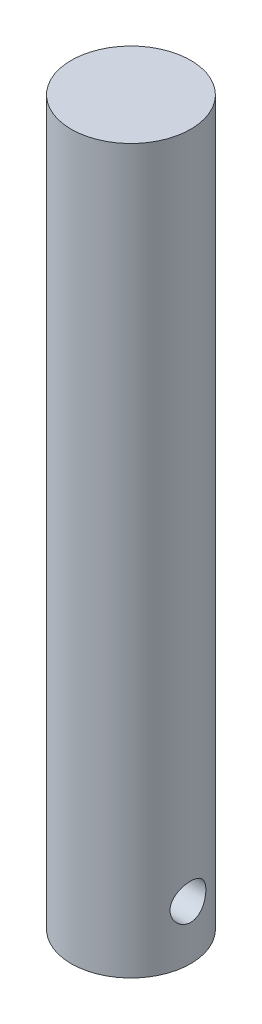
ISO-10303-21;
HEADER;
FILE_DESCRIPTION(('STEP AP214'),'2;1');
FILE_NAME('part.step','',(''),(''),'','','');
FILE_SCHEMA(('AUTOMOTIVE_DESIGN { 1 0 10303 214 1 1 1 1 }'));
ENDSEC;
DATA;
#1=APPLICATION_CONTEXT('core data for automotive mechanical design processes');
#2=APPLICATION_PROTOCOL_DEFINITION('international standard','automotive_design',2000,#1);
#3=PRODUCT_CONTEXT('',#1,'mechanical');
#4=PRODUCT('Part','Part','',(#3));
#5=PRODUCT_RELATED_PRODUCT_CATEGORY('part','',(#4));
#6=PRODUCT_DEFINITION_FORMATION('','',#4);
#7=PRODUCT_DEFINITION_CONTEXT('part definition',#1,'design');
#8=PRODUCT_DEFINITION('design','',#6,#7);
#9=PRODUCT_DEFINITION_SHAPE('','',#8);
#10=(LENGTH_UNIT() NAMED_UNIT(*) SI_UNIT(.MILLI.,.METRE.));
#11=(NAMED_UNIT(*) PLANE_ANGLE_UNIT() SI_UNIT($,.RADIAN.));
#12=(NAMED_UNIT(*) SI_UNIT($,.STERADIAN.) SOLID_ANGLE_UNIT());
#13=UNCERTAINTY_MEASURE_WITH_UNIT(LENGTH_MEASURE(1.E-05),#10,'distance_accuracy_value','');
#14=(GEOMETRIC_REPRESENTATION_CONTEXT(3) GLOBAL_UNCERTAINTY_ASSIGNED_CONTEXT((#13)) GLOBAL_UNIT_ASSIGNED_CONTEXT((#10,
#11,#12)) REPRESENTATION_CONTEXT('',''));
#15=CARTESIAN_POINT('',(0.,0.,0.));
#16=DIRECTION('',(0.,0.,1.));
#17=DIRECTION('',(1.,0.,0.));
#18=AXIS2_PLACEMENT_3D('',#15,#16,#17);
#19=CARTESIAN_POINT('',(0.,-21.,0.));
#20=DIRECTION('',(0.,1.,0.));
#21=DIRECTION('',(0.,0.,1.));
#22=AXIS2_PLACEMENT_3D('',#19,#20,#21);
#23=CYLINDRICAL_SURFACE('',#22,10.);
#24=CARTESIAN_POINT('',(-9.53939201416945,-12.,-3.));
#25=CARTESIAN_POINT('',(-9.53939371453959,-12.1643890958848,-2.99999795267528));
#26=CARTESIAN_POINT('',(-9.54368780418137,-12.3287984482881,-2.98644216334284));
#27=CARTESIAN_POINT('',(-9.56033156605799,-12.6528104991839,-2.93271688893498));
#28=CARTESIAN_POINT('',(-9.57268392986936,-12.8124115730029,-2.89253851147156));
#29=CARTESIAN_POINT('',(-9.60392204971265,-13.1220694565435,-2.78705506539911));
#30=CARTESIAN_POINT('',(-9.62279693406464,-13.2721416592662,-2.72179178788487));
#31=CARTESIAN_POINT('',(-9.66493865095134,-13.5592438679906,-2.56812843835858));
#32=CARTESIAN_POINT('',(-9.68820614082039,-13.6962719173689,-2.47972490274105));
#33=CARTESIAN_POINT('',(-9.73733724371531,-13.9577327811548,-2.27929508283254));
#34=CARTESIAN_POINT('',(-9.76325616623271,-14.0816917958926,-2.16666414351613));
#35=CARTESIAN_POINT('',(-9.81429723873514,-14.309275902645,-1.9222724751592));
#36=CARTESIAN_POINT('',(-9.8394192859541,-14.4128983808998,-1.79050929092222));
#37=CARTESIAN_POINT('',(-9.88666429158777,-14.5989253996666,-1.50822287558738));
#38=CARTESIAN_POINT('',(-9.90871448684808,-14.6808468488856,-1.35736804267163));
#39=CARTESIAN_POINT('',(-9.94668871841369,-14.8179745180855,-1.04324929073871));
#40=CARTESIAN_POINT('',(-9.96261407578992,-14.8731864997149,-0.879988056775822));
#41=CARTESIAN_POINT('',(-9.98615292007177,-14.953760002181,-0.550647705261659));
#42=CARTESIAN_POINT('',(-9.99399114738673,-14.9799302553054,-0.384782797907603));
#43=CARTESIAN_POINT('',(-10.001264030027,-15.0042346492929,-0.0508436474986282));
#44=CARTESIAN_POINT('',(-10.0007004504217,-15.0023746788039,0.117230124100743));
#45=CARTESIAN_POINT('',(-9.99139207635305,-14.971214262914,0.445142313200314));
#46=CARTESIAN_POINT('',(-9.98290840410475,-14.9427896123803,0.60507253528266));
#47=CARTESIAN_POINT('',(-9.95903044225231,-14.8607373280114,0.917778426885075));
#48=CARTESIAN_POINT('',(-9.9436357150134,-14.8071080981145,1.07055364264578));
#49=CARTESIAN_POINT('',(-9.90730441973756,-14.675575953163,1.36669465270248));
#50=CARTESIAN_POINT('',(-9.88630539352772,-14.5973975943861,1.50993012938864));
#51=CARTESIAN_POINT('',(-9.84099281296777,-14.419204295143,1.78152934756663));
#52=CARTESIAN_POINT('',(-9.81667847277943,-14.3191841740708,1.90988954974545));
#53=CARTESIAN_POINT('',(-9.76623100973852,-14.0956044984991,2.15332096305837));
#54=CARTESIAN_POINT('',(-9.74006390633503,-13.9712861619492,2.26768916079755));
#55=CARTESIAN_POINT('',(-9.68967959784414,-13.7049799642112,2.47415303080115));
#56=CARTESIAN_POINT('',(-9.66546258669242,-13.562990349189,2.56624648967452));
#57=CARTESIAN_POINT('',(-9.62155806359712,-13.2635210615278,2.72627990669511));
#58=CARTESIAN_POINT('',(-9.6019162125849,-13.1059059083825,2.79397978469378));
#59=CARTESIAN_POINT('',(-9.56992784963789,-12.7807855832214,2.90166725750739));
#60=CARTESIAN_POINT('',(-9.55757895796639,-12.6132836569649,2.94166389279494));
#61=CARTESIAN_POINT('',(-9.54209699116239,-12.2798352784976,2.99149540565762));
#62=CARTESIAN_POINT('',(-9.53863757349917,-12.1140635522056,3.00239892760807));
#63=CARTESIAN_POINT('',(-9.54042384874812,-11.7830541999867,2.99671894465741));
#64=CARTESIAN_POINT('',(-9.54566832310786,-11.61781650254,2.98013928742559));
#65=CARTESIAN_POINT('',(-9.56395117112153,-11.2970232440566,2.92091527148479));
#66=CARTESIAN_POINT('',(-9.57678353015602,-11.1413276714725,2.87895922862587));
#67=CARTESIAN_POINT('',(-9.6085828246183,-10.8391966183706,2.77097155495853));
#68=CARTESIAN_POINT('',(-9.62755070717977,-10.692762571719,2.70493620685512));
#69=CARTESIAN_POINT('',(-9.67011670046268,-10.4089650718556,2.54863742393008));
#70=CARTESIAN_POINT('',(-9.69382542139644,-10.2719505580284,2.4577712834546));
#71=CARTESIAN_POINT('',(-9.74296411293927,-10.0147237876384,2.25510603200767));
#72=CARTESIAN_POINT('',(-9.76839449459993,-9.89451556477443,2.14330191069792));
#73=CARTESIAN_POINT('',(-9.81927267096329,-9.66963918837052,1.8969102649872));
#74=CARTESIAN_POINT('',(-9.84468490126011,-9.56572874202603,1.76162213171487));
#75=CARTESIAN_POINT('',(-9.89169703497297,-9.3820665979445,1.4749235691805));
#76=CARTESIAN_POINT('',(-9.91329712769433,-9.30231370043708,1.32351394108789));
#77=CARTESIAN_POINT('',(-9.95011940949915,-9.16999993886341,1.00987100941044));
#78=CARTESIAN_POINT('',(-9.96538906849931,-9.11723596768205,0.847729244075677));
#79=CARTESIAN_POINT('',(-9.98803959193653,-9.03987816221916,0.516339933009176));
#80=CARTESIAN_POINT('',(-9.9954227134176,-9.01527626810317,0.347094434709525));
#81=CARTESIAN_POINT('',(-10.001330881628,-8.995553911891,0.0133043077654852));
#82=CARTESIAN_POINT('',(-10.0001861022264,-8.99933460918434,-0.151170358172414));
#83=CARTESIAN_POINT('',(-9.98994528930073,-9.03364326499824,-0.477038962328808));
#84=CARTESIAN_POINT('',(-9.98084970660925,-9.06416970696089,-0.638433074693057));
#85=CARTESIAN_POINT('',(-9.95582336716653,-9.15042332279925,-0.951871626082716));
#86=CARTESIAN_POINT('',(-9.93996705801731,-9.20587636129803,-1.10399785470278));
#87=CARTESIAN_POINT('',(-9.90305886078899,-9.34016382901438,-1.39686647550411));
#88=CARTESIAN_POINT('',(-9.88200611899892,-9.41900210057238,-1.53760699210116));
#89=CARTESIAN_POINT('',(-9.83607931656456,-9.60074691486007,-1.80860378484113));
#90=CARTESIAN_POINT('',(-9.81110453847118,-9.70434286000154,-1.93838050015353));
#91=CARTESIAN_POINT('',(-9.76047074424667,-9.9314207766656,-2.17907514269189));
#92=CARTESIAN_POINT('',(-9.73481153282158,-10.0549084757963,-2.28998761920387));
#93=CARTESIAN_POINT('',(-9.68481361262638,-10.322681556621,-2.49312538789097));
#94=CARTESIAN_POINT('',(-9.6605370538697,-10.4674771067809,-2.58469519515913));
#95=CARTESIAN_POINT('',(-9.61705095017586,-10.771110348322,-2.74208627057551));
#96=CARTESIAN_POINT('',(-9.59783897193911,-10.9299412472024,-2.80791991114577));
#97=CARTESIAN_POINT('',(-9.56855633435189,-11.2394808632126,-2.90603885065899));
#98=CARTESIAN_POINT('',(-9.5577230968104,-11.389217293862,-2.94117718022463));
#99=CARTESIAN_POINT('',(-9.54314085194333,-11.6926304449915,-2.98815637670288));
#100=CARTESIAN_POINT('',(-9.53939042442861,-11.8463063692905,-3.00000191412191));
#101=CARTESIAN_POINT('',(-9.53939201416945,-12.,-3.));
#102=B_SPLINE_CURVE_WITH_KNOTS('',3,(#24,#25,#26,#27,#28,#29,#30,#31,#32,#33,#34,#35,#36,#37,
#38,#39,#40,#41,#42,#43,#44,#45,#46,#47,#48,#49,#50,#51,#52,#53,#54,#55,#56,#57,#58,#59,#60,#61,
#62,#63,#64,#65,#66,#67,#68,#69,#70,#71,#72,#73,#74,#75,#76,#77,#78,#79,#80,#81,#82,#83,#84,#85,
#86,#87,#88,#89,#90,#91,#92,#93,#94,#95,#96,#97,#98,#99,#100,#101),.UNSPECIFIED.,.T.,.F.,(4,2,2,
2,2,2,2,2,2,2,2,2,2,2,2,2,2,2,2,2,2,2,2,2,2,2,2,2,2,2,2,2,2,2,2,2,2,2,4),(0.,0.492600331831084,
0.985365283377999,1.47731282893239,1.9693340507402,2.47546300015968,2.98165695742546,
3.49831878547289,4.01486911175754,4.51664280299115,5.01831108202881,5.5040025198176,
5.98972471780752,6.48110418671353,6.97260033181661,7.48304294046556,7.99353624983726,
8.50892476494934,9.02414501262033,9.52016161585829,10.0161087821999,10.4991718988284,
10.9823096209678,11.4784146362399,11.9746385186306,12.4895901220641,13.0045161465361,
13.5155078363386,14.0263532464857,14.5175260782765,15.0086710610072,15.4945419374965,
15.9804926898797,16.4819925411419,16.9836370526499,17.500232793435,18.016579879331,
18.4772230772011,18.9377739007233),.UNSPECIFIED.);
#103=CARTESIAN_POINT('',(-9.53939201416945,-12.,-3.));
#104=VERTEX_POINT('',#103);
#105=EDGE_CURVE('E38',#104,#104,#102,.T.);
#106=ORIENTED_EDGE('',*,*,#105,.F.);
#107=EDGE_LOOP('',(#106));
#108=FACE_BOUND('',#107,.T.);
#109=CARTESIAN_POINT('',(9.53939201416946,-12.,-3.));
#110=CARTESIAN_POINT('',(9.5393937145396,-11.8356109041152,-2.99999795267528));
#111=CARTESIAN_POINT('',(9.54368780418137,-11.671201551712,-2.98644216334284));
#112=CARTESIAN_POINT('',(9.56033156605799,-11.3471895008161,-2.93271688893498));
#113=CARTESIAN_POINT('',(9.57268392986935,-11.1875884269971,-2.89253851147156));
#114=CARTESIAN_POINT('',(9.60392204971265,-10.8779305434565,-2.78705506539911));
#115=CARTESIAN_POINT('',(9.62279693406464,-10.7278583407338,-2.72179178788487));
#116=CARTESIAN_POINT('',(9.66493865095134,-10.4407561320094,-2.56812843835858));
#117=CARTESIAN_POINT('',(9.68820614082039,-10.3037280826311,-2.47972490274105));
#118=CARTESIAN_POINT('',(9.73733724371531,-10.0422672188453,-2.27929508283254));
#119=CARTESIAN_POINT('',(9.76325616623271,-9.91830820410743,-2.16666414351613));
#120=CARTESIAN_POINT('',(9.81429723873514,-9.69072409735498,-1.9222724751592));
#121=CARTESIAN_POINT('',(9.8394192859541,-9.58710161910024,-1.79050929092222));
#122=CARTESIAN_POINT('',(9.88666429158777,-9.40107460033339,-1.50822287558738));
#123=CARTESIAN_POINT('',(9.90871448684808,-9.31915315111438,-1.35736804267163));
#124=CARTESIAN_POINT('',(9.94668871841369,-9.18202548191449,-1.04324929073871));
#125=CARTESIAN_POINT('',(9.96261407578992,-9.1268135002851,-0.879988056775822));
#126=CARTESIAN_POINT('',(9.98615292007177,-9.04623999781898,-0.550647705261658));
#127=CARTESIAN_POINT('',(9.99399114738673,-9.0200697446946,-0.384782797907602));
#128=CARTESIAN_POINT('',(10.001264030027,-8.99576535070712,-0.0508436474986273));
#129=CARTESIAN_POINT('',(10.0007004504217,-8.99762532119609,0.117230124100744));
#130=CARTESIAN_POINT('',(9.99139207635305,-9.02878573708604,0.445142313200315));
#131=CARTESIAN_POINT('',(9.98290840410475,-9.0572103876197,0.605072535282661));
#132=CARTESIAN_POINT('',(9.95903044225231,-9.13926267198862,0.917778426885076));
#133=CARTESIAN_POINT('',(9.9436357150134,-9.1928919018855,1.07055364264578));
#134=CARTESIAN_POINT('',(9.90730441973756,-9.32442404683696,1.36669465270248));
#135=CARTESIAN_POINT('',(9.88630539352772,-9.40260240561395,1.50993012938864));
#136=CARTESIAN_POINT('',(9.84099281296777,-9.58079570485705,1.78152934756663));
#137=CARTESIAN_POINT('',(9.81667847277943,-9.68081582592917,1.90988954974545));
#138=CARTESIAN_POINT('',(9.76623100973852,-9.90439550150091,2.15332096305837));
#139=CARTESIAN_POINT('',(9.74006390633502,-10.0287138380508,2.26768916079755));
#140=CARTESIAN_POINT('',(9.68967959784414,-10.2950200357888,2.47415303080115));
#141=CARTESIAN_POINT('',(9.66546258669242,-10.437009650811,2.56624648967452));
#142=CARTESIAN_POINT('',(9.62155806359712,-10.7364789384722,2.72627990669512));
#143=CARTESIAN_POINT('',(9.6019162125849,-10.8940940916175,2.79397978469378));
#144=CARTESIAN_POINT('',(9.5699278496379,-11.2192144167786,2.90166725750739));
#145=CARTESIAN_POINT('',(9.55757895796639,-11.3867163430351,2.94166389279494));
#146=CARTESIAN_POINT('',(9.54209699116239,-11.7201647215024,2.99149540565762));
#147=CARTESIAN_POINT('',(9.53863757349917,-11.8859364477944,3.00239892760807));
#148=CARTESIAN_POINT('',(9.54042384874812,-12.2169458000133,2.99671894465741));
#149=CARTESIAN_POINT('',(9.54566832310786,-12.38218349746,2.98013928742559));
#150=CARTESIAN_POINT('',(9.56395117112153,-12.7029767559434,2.92091527148479));
#151=CARTESIAN_POINT('',(9.57678353015602,-12.8586723285275,2.87895922862587));
#152=CARTESIAN_POINT('',(9.6085828246183,-13.1608033816294,2.77097155495853));
#153=CARTESIAN_POINT('',(9.62755070717977,-13.307237428281,2.70493620685512));
#154=CARTESIAN_POINT('',(9.67011670046268,-13.5910349281444,2.54863742393008));
#155=CARTESIAN_POINT('',(9.69382542139644,-13.7280494419716,2.4577712834546));
#156=CARTESIAN_POINT('',(9.74296411293927,-13.9852762123616,2.25510603200767));
#157=CARTESIAN_POINT('',(9.76839449459993,-14.1054844352256,2.14330191069792));
#158=CARTESIAN_POINT('',(9.81927267096329,-14.3303608116295,1.8969102649872));
#159=CARTESIAN_POINT('',(9.84468490126011,-14.434271257974,1.76162213171487));
#160=CARTESIAN_POINT('',(9.89169703497297,-14.6179334020555,1.47492356918049));
#161=CARTESIAN_POINT('',(9.91329712769433,-14.6976862995629,1.32351394108789));
#162=CARTESIAN_POINT('',(9.95011940949915,-14.8300000611366,1.00987100941044));
#163=CARTESIAN_POINT('',(9.96538906849931,-14.882764032318,0.847729244075675));
#164=CARTESIAN_POINT('',(9.98803959193653,-14.9601218377808,0.516339933009173));
#165=CARTESIAN_POINT('',(9.9954227134176,-14.9847237318968,0.347094434709523));
#166=CARTESIAN_POINT('',(10.001330881628,-15.004446088109,0.0133043077654841));
#167=CARTESIAN_POINT('',(10.0001861022264,-15.0006653908157,-0.151170358172415));
#168=CARTESIAN_POINT('',(9.98994528930073,-14.9663567350018,-0.477038962328809));
#169=CARTESIAN_POINT('',(9.98084970660925,-14.9358302930391,-0.638433074693059));
#170=CARTESIAN_POINT('',(9.95582336716653,-14.8495766772008,-0.951871626082718));
#171=CARTESIAN_POINT('',(9.93996705801731,-14.794123638702,-1.10399785470279));
#172=CARTESIAN_POINT('',(9.90305886078899,-14.6598361709856,-1.39686647550411));
#173=CARTESIAN_POINT('',(9.88200611899892,-14.5809978994276,-1.53760699210116));
#174=CARTESIAN_POINT('',(9.83607931656456,-14.3992530851399,-1.80860378484113));
#175=CARTESIAN_POINT('',(9.81110453847118,-14.2956571399985,-1.93838050015354));
#176=CARTESIAN_POINT('',(9.76047074424667,-14.0685792233344,-2.17907514269189));
#177=CARTESIAN_POINT('',(9.73481153282158,-13.9450915242037,-2.28998761920387));
#178=CARTESIAN_POINT('',(9.68481361262638,-13.677318443379,-2.49312538789097));
#179=CARTESIAN_POINT('',(9.6605370538697,-13.5325228932191,-2.58469519515913));
#180=CARTESIAN_POINT('',(9.61705095017586,-13.228889651678,-2.74208627057551));
#181=CARTESIAN_POINT('',(9.59783897193911,-13.0700587527976,-2.80791991114577));
#182=CARTESIAN_POINT('',(9.56855633435189,-12.7605191367875,-2.90603885065899));
#183=CARTESIAN_POINT('',(9.5577230968104,-12.610782706138,-2.94117718022463));
#184=CARTESIAN_POINT('',(9.54314085194333,-12.3073695550085,-2.98815637670288));
#185=CARTESIAN_POINT('',(9.53939042442861,-12.1536936307095,-3.00000191412191));
#186=CARTESIAN_POINT('',(9.53939201416946,-12.,-3.));
#187=B_SPLINE_CURVE_WITH_KNOTS('',3,(#109,#110,#111,#112,#113,#114,#115,#116,#117,#118,#119,
#120,#121,#122,#123,#124,#125,#126,#127,#128,#129,#130,#131,#132,#133,#134,#135,#136,#137,#138,
#139,#140,#141,#142,#143,#144,#145,#146,#147,#148,#149,#150,#151,#152,#153,#154,#155,#156,#157,
#158,#159,#160,#161,#162,#163,#164,#165,#166,#167,#168,#169,#170,#171,#172,#173,#174,#175,#176,
#177,#178,#179,#180,#181,#182,#183,#184,#185,#186),.UNSPECIFIED.,.T.,.F.,(4,2,2,2,2,2,2,2,2,2,2,
2,2,2,2,2,2,2,2,2,2,2,2,2,2,2,2,2,2,2,2,2,2,2,2,2,2,2,4),(0.,0.492600331831085,
0.985365283377999,1.47731282893239,1.9693340507402,2.47546300015968,2.98165695742546,
3.49831878547289,4.01486911175754,4.51664280299115,5.01831108202881,5.5040025198176,
5.98972471780752,6.48110418671353,6.97260033181661,7.48304294046556,7.99353624983726,
8.50892476494934,9.02414501262032,9.52016161585829,10.0161087821998,10.4991718988284,
10.9823096209678,11.4784146362399,11.9746385186306,12.4895901220641,13.0045161465361,
13.5155078363386,14.0263532464857,14.5175260782765,15.0086710610072,15.4945419374965,
15.9804926898797,16.4819925411419,16.9836370526499,17.500232793435,18.016579879331,
18.477223077201,18.9377739007233),.UNSPECIFIED.);
#188=CARTESIAN_POINT('',(9.53939201416946,-12.,-3.));
#189=VERTEX_POINT('',#188);
#190=EDGE_CURVE('E52',#189,#189,#187,.T.);
#191=ORIENTED_EDGE('',*,*,#190,.F.);
#192=EDGE_LOOP('',(#191));
#193=FACE_BOUND('',#192,.T.);
#194=CARTESIAN_POINT('',(0.,-21.,0.));
#195=DIRECTION('',(0.,1.,0.));
#196=DIRECTION('',(0.,0.,1.));
#197=AXIS2_PLACEMENT_3D('',#194,#195,#196);
#198=CIRCLE('',#197,10.);
#199=CARTESIAN_POINT('',(0.,-21.,10.));
#200=VERTEX_POINT('',#199);
#201=EDGE_CURVE('E10',#200,#200,#198,.T.);
#202=ORIENTED_EDGE('',*,*,#201,.T.);
#203=EDGE_LOOP('',(#202));
#204=FACE_BOUND('',#203,.T.);
#205=CARTESIAN_POINT('',(0.,100.,0.));
#206=DIRECTION('',(0.,1.,0.));
#207=DIRECTION('',(0.,0.,1.));
#208=AXIS2_PLACEMENT_3D('',#205,#206,#207);
#209=CIRCLE('',#208,10.);
#210=CARTESIAN_POINT('',(0.,100.,10.));
#211=VERTEX_POINT('',#210);
#212=EDGE_CURVE('E46',#211,#211,#209,.T.);
#213=ORIENTED_EDGE('',*,*,#212,.F.);
#214=EDGE_LOOP('',(#213));
#215=FACE_BOUND('',#214,.T.);
#216=ADVANCED_FACE('F34',(#108,#193,#204,#215),#23,.T.);
#217=CARTESIAN_POINT('',(0.,-21.,0.));
#218=DIRECTION('',(0.,1.,0.));
#219=DIRECTION('',(0.,0.,1.));
#220=AXIS2_PLACEMENT_3D('',#217,#218,#219);
#221=PLANE('',#220);
#222=ORIENTED_EDGE('',*,*,#201,.F.);
#223=EDGE_LOOP('',(#222));
#224=FACE_BOUND('',#223,.T.);
#225=ADVANCED_FACE('F65',(#224),#221,.F.);
#226=CARTESIAN_POINT('',(0.,100.,0.));
#227=DIRECTION('',(0.,1.,0.));
#228=DIRECTION('',(0.,0.,1.));
#229=AXIS2_PLACEMENT_3D('',#226,#227,#228);
#230=PLANE('',#229);
#231=ORIENTED_EDGE('',*,*,#212,.T.);
#232=EDGE_LOOP('',(#231));
#233=FACE_BOUND('',#232,.T.);
#234=ADVANCED_FACE('F61',(#233),#230,.T.);
#235=CARTESIAN_POINT('',(-12.5,-12.,0.));
#236=DIRECTION('',(1.,0.,0.));
#237=DIRECTION('',(0.,0.,-1.));
#238=AXIS2_PLACEMENT_3D('',#235,#236,#237);
#239=CYLINDRICAL_SURFACE('',#238,3.);
#240=ORIENTED_EDGE('',*,*,#105,.T.);
#241=EDGE_LOOP('',(#240));
#242=FACE_BOUND('',#241,.T.);
#243=ORIENTED_EDGE('',*,*,#190,.T.);
#244=EDGE_LOOP('',(#243));
#245=FACE_BOUND('',#244,.T.);
#246=ADVANCED_FACE('F57',(#242,#245),#239,.F.);
#247=CLOSED_SHELL('',(#216,#225,#234,#246));
#248=MANIFOLD_SOLID_BREP('B2',#247);
#249=ADVANCED_BREP_SHAPE_REPRESENTATION('',(#18,#248),#14);
#250=SHAPE_DEFINITION_REPRESENTATION(#9,#249);
ENDSEC;
END-ISO-10303-21;
